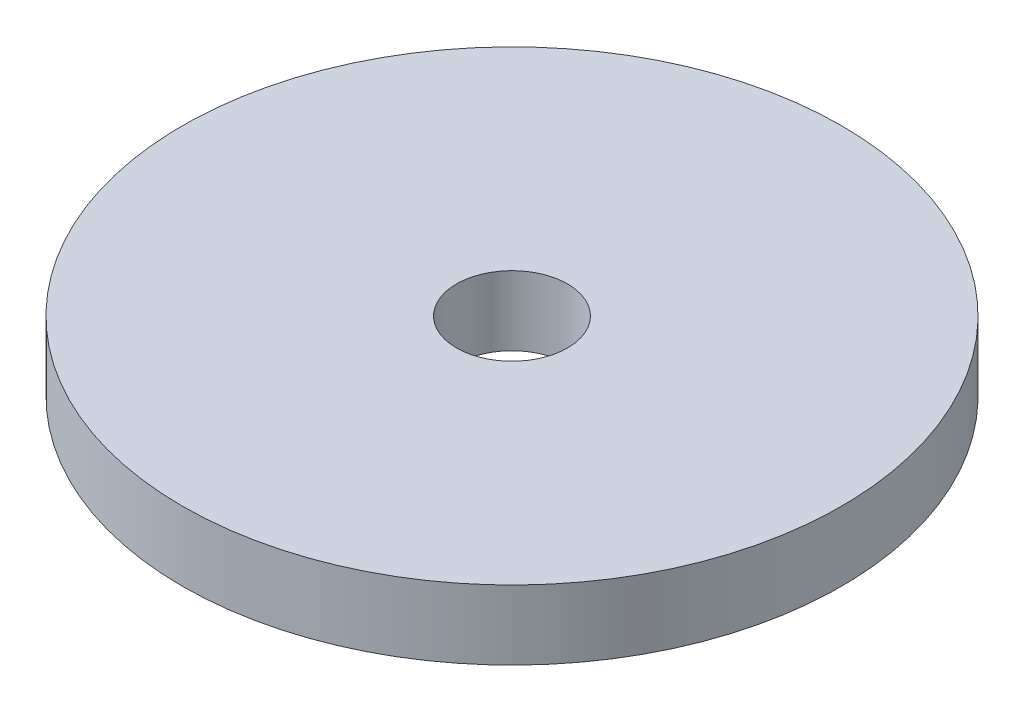
ISO-10303-21;
HEADER;
FILE_DESCRIPTION(('STEP AP214'),'2;1');
FILE_NAME('part.step','',(''),(''),'','','');
FILE_SCHEMA(('AUTOMOTIVE_DESIGN { 1 0 10303 214 1 1 1 1 }'));
ENDSEC;
DATA;
#1=APPLICATION_CONTEXT('core data for automotive mechanical design processes');
#2=APPLICATION_PROTOCOL_DEFINITION('international standard','automotive_design',2000,#1);
#3=PRODUCT_CONTEXT('',#1,'mechanical');
#4=PRODUCT('Part','Part','',(#3));
#5=PRODUCT_RELATED_PRODUCT_CATEGORY('part','',(#4));
#6=PRODUCT_DEFINITION_FORMATION('','',#4);
#7=PRODUCT_DEFINITION_CONTEXT('part definition',#1,'design');
#8=PRODUCT_DEFINITION('design','',#6,#7);
#9=PRODUCT_DEFINITION_SHAPE('','',#8);
#10=(LENGTH_UNIT() NAMED_UNIT(*) SI_UNIT(.MILLI.,.METRE.));
#11=(NAMED_UNIT(*) PLANE_ANGLE_UNIT() SI_UNIT($,.RADIAN.));
#12=(NAMED_UNIT(*) SI_UNIT($,.STERADIAN.) SOLID_ANGLE_UNIT());
#13=UNCERTAINTY_MEASURE_WITH_UNIT(LENGTH_MEASURE(1.E-05),#10,'distance_accuracy_value','');
#14=(GEOMETRIC_REPRESENTATION_CONTEXT(3) GLOBAL_UNCERTAINTY_ASSIGNED_CONTEXT((#13)) GLOBAL_UNIT_ASSIGNED_CONTEXT((#10,
#11,#12)) REPRESENTATION_CONTEXT('',''));
#15=CARTESIAN_POINT('',(0.,0.,0.));
#16=DIRECTION('',(0.,0.,1.));
#17=DIRECTION('',(1.,0.,0.));
#18=AXIS2_PLACEMENT_3D('',#15,#16,#17);
#19=CARTESIAN_POINT('',(0.,2.54,0.));
#20=DIRECTION('',(0.,1.,0.));
#21=DIRECTION('',(0.,0.,1.));
#22=AXIS2_PLACEMENT_3D('',#19,#20,#21);
#23=PLANE('',#22);
#24=CARTESIAN_POINT('',(0.,2.54,0.));
#25=DIRECTION('',(0.,1.,0.));
#26=DIRECTION('',(0.,0.,1.));
#27=AXIS2_PLACEMENT_3D('',#24,#25,#26);
#28=CIRCLE('',#27,12.065);
#29=CARTESIAN_POINT('',(0.,2.54,12.065));
#30=VERTEX_POINT('',#29);
#31=EDGE_CURVE('E10',#30,#30,#28,.T.);
#32=ORIENTED_EDGE('',*,*,#31,.T.);
#33=EDGE_LOOP('',(#32));
#34=FACE_BOUND('',#33,.T.);
#35=CARTESIAN_POINT('',(0.,2.54,0.));
#36=DIRECTION('',(0.,1.,0.));
#37=DIRECTION('',(0.,0.,1.));
#38=AXIS2_PLACEMENT_3D('',#35,#36,#37);
#39=CIRCLE('',#38,2.032);
#40=CARTESIAN_POINT('',(0.,2.54,2.032));
#41=VERTEX_POINT('',#40);
#42=EDGE_CURVE('E50',#41,#41,#39,.T.);
#43=ORIENTED_EDGE('',*,*,#42,.F.);
#44=EDGE_LOOP('',(#43));
#45=FACE_BOUND('',#44,.T.);
#46=ADVANCED_FACE('F37',(#34,#45),#23,.T.);
#47=CARTESIAN_POINT('',(0.,0.,0.));
#48=DIRECTION('',(0.,1.,0.));
#49=DIRECTION('',(0.,0.,1.));
#50=AXIS2_PLACEMENT_3D('',#47,#48,#49);
#51=PLANE('',#50);
#52=CARTESIAN_POINT('',(0.,0.,0.));
#53=DIRECTION('',(0.,1.,0.));
#54=DIRECTION('',(0.,0.,1.));
#55=AXIS2_PLACEMENT_3D('',#52,#53,#54);
#56=CIRCLE('',#55,12.065);
#57=CARTESIAN_POINT('',(0.,0.,12.065));
#58=VERTEX_POINT('',#57);
#59=EDGE_CURVE('E41',#58,#58,#56,.T.);
#60=ORIENTED_EDGE('',*,*,#59,.F.);
#61=EDGE_LOOP('',(#60));
#62=FACE_BOUND('',#61,.T.);
#63=CARTESIAN_POINT('',(0.,0.,0.));
#64=DIRECTION('',(0.,1.,0.));
#65=DIRECTION('',(0.,0.,1.));
#66=AXIS2_PLACEMENT_3D('',#63,#64,#65);
#67=CIRCLE('',#66,2.032);
#68=CARTESIAN_POINT('',(0.,0.,2.032));
#69=VERTEX_POINT('',#68);
#70=EDGE_CURVE('E52',#69,#69,#67,.T.);
#71=ORIENTED_EDGE('',*,*,#70,.T.);
#72=EDGE_LOOP('',(#71));
#73=FACE_BOUND('',#72,.T.);
#74=ADVANCED_FACE('F64',(#62,#73),#51,.F.);
#75=CARTESIAN_POINT('',(0.,2.54,0.));
#76=DIRECTION('',(0.,-1.,0.));
#77=DIRECTION('',(0.,0.,-1.));
#78=AXIS2_PLACEMENT_3D('',#75,#76,#77);
#79=CYLINDRICAL_SURFACE('',#78,12.065);
#80=ORIENTED_EDGE('',*,*,#31,.F.);
#81=EDGE_LOOP('',(#80));
#82=FACE_BOUND('',#81,.T.);
#83=ORIENTED_EDGE('',*,*,#59,.T.);
#84=EDGE_LOOP('',(#83));
#85=FACE_BOUND('',#84,.T.);
#86=ADVANCED_FACE('F39',(#82,#85),#79,.T.);
#87=CARTESIAN_POINT('',(0.,2.54,0.));
#88=DIRECTION('',(0.,-1.,0.));
#89=DIRECTION('',(0.,0.,-1.));
#90=AXIS2_PLACEMENT_3D('',#87,#88,#89);
#91=CYLINDRICAL_SURFACE('',#90,2.032);
#92=ORIENTED_EDGE('',*,*,#42,.T.);
#93=EDGE_LOOP('',(#92));
#94=FACE_BOUND('',#93,.T.);
#95=ORIENTED_EDGE('',*,*,#70,.F.);
#96=EDGE_LOOP('',(#95));
#97=FACE_BOUND('',#96,.T.);
#98=ADVANCED_FACE('F60',(#94,#97),#91,.F.);
#99=CLOSED_SHELL('',(#46,#74,#86,#98));
#100=MANIFOLD_SOLID_BREP('B2',#99);
#101=ADVANCED_BREP_SHAPE_REPRESENTATION('',(#18,#100),#14);
#102=SHAPE_DEFINITION_REPRESENTATION(#9,#101);
ENDSEC;
END-ISO-10303-21;
